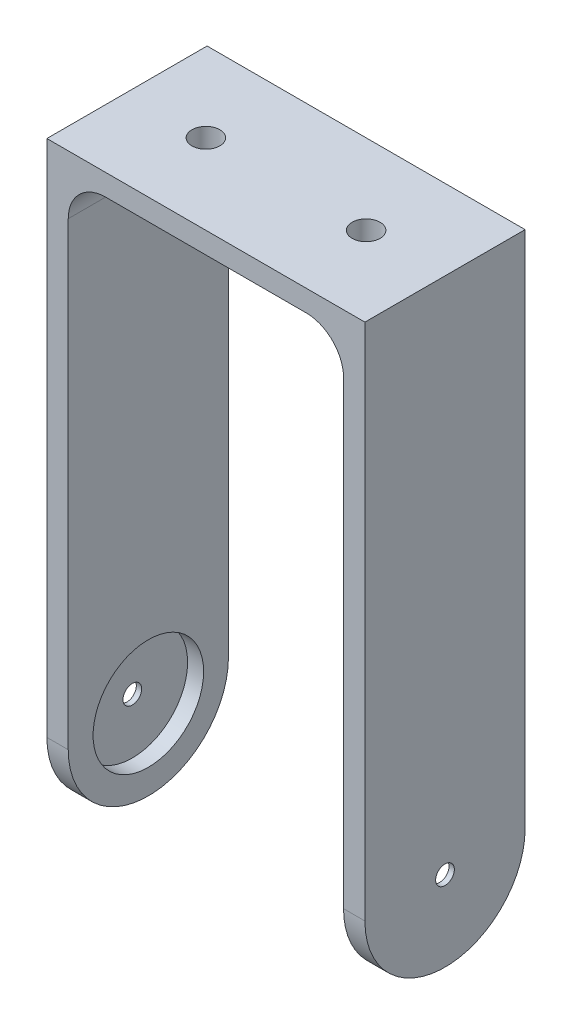
ISO-10303-21;
HEADER;
FILE_DESCRIPTION(('STEP AP214'),'2;1');
FILE_NAME('part.step','',(''),(''),'','','');
FILE_SCHEMA(('AUTOMOTIVE_DESIGN { 1 0 10303 214 1 1 1 1 }'));
ENDSEC;
DATA;
#1=APPLICATION_CONTEXT('core data for automotive mechanical design processes');
#2=APPLICATION_PROTOCOL_DEFINITION('international standard','automotive_design',2000,#1);
#3=PRODUCT_CONTEXT('',#1,'mechanical');
#4=PRODUCT('Part','Part','',(#3));
#5=PRODUCT_RELATED_PRODUCT_CATEGORY('part','',(#4));
#6=PRODUCT_DEFINITION_FORMATION('','',#4);
#7=PRODUCT_DEFINITION_CONTEXT('part definition',#1,'design');
#8=PRODUCT_DEFINITION('design','',#6,#7);
#9=PRODUCT_DEFINITION_SHAPE('','',#8);
#10=(LENGTH_UNIT() NAMED_UNIT(*) SI_UNIT(.MILLI.,.METRE.));
#11=(NAMED_UNIT(*) PLANE_ANGLE_UNIT() SI_UNIT($,.RADIAN.));
#12=(NAMED_UNIT(*) SI_UNIT($,.STERADIAN.) SOLID_ANGLE_UNIT());
#13=UNCERTAINTY_MEASURE_WITH_UNIT(LENGTH_MEASURE(1.E-05),#10,'distance_accuracy_value','');
#14=(GEOMETRIC_REPRESENTATION_CONTEXT(3) GLOBAL_UNCERTAINTY_ASSIGNED_CONTEXT((#13)) GLOBAL_UNIT_ASSIGNED_CONTEXT((#10,
#11,#12)) REPRESENTATION_CONTEXT('',''));
#15=CARTESIAN_POINT('',(0.,0.,0.));
#16=DIRECTION('',(0.,0.,1.));
#17=DIRECTION('',(1.,0.,0.));
#18=AXIS2_PLACEMENT_3D('',#15,#16,#17);
#19=CARTESIAN_POINT('',(25.7740385147519,-24.3,15.));
#20=DIRECTION('',(1.,0.,0.));
#21=DIRECTION('',(0.,0.,-1.));
#22=AXIS2_PLACEMENT_3D('',#19,#20,#21);
#23=PLANE('',#22);
#24=CARTESIAN_POINT('',(25.7740385147519,0.,0.));
#25=DIRECTION('',(1.,0.,0.));
#26=DIRECTION('',(0.,0.,-1.));
#27=AXIS2_PLACEMENT_3D('',#24,#25,#26);
#28=CIRCLE('',#27,15.);
#29=CARTESIAN_POINT('',(25.7740385147519,0.,15.));
#30=VERTEX_POINT('',#29);
#31=CARTESIAN_POINT('',(25.7740385147519,-14.5162799625254,3.77857328228293));
#32=VERTEX_POINT('',#31);
#33=EDGE_CURVE('E264',#30,#32,#28,.T.);
#34=ORIENTED_EDGE('',*,*,#33,.F.);
#35=DIRECTION('',(0.,1.,0.));
#36=VECTOR('',#35,1.);
#37=CARTESIAN_POINT('',(25.7740385147519,-24.3,15.));
#38=LINE('',#37,#36);
#39=CARTESIAN_POINT('',(25.7740385147519,86.1173023617038,15.));
#40=VERTEX_POINT('',#39);
#41=EDGE_CURVE('E208',#40,#30,#38,.F.);
#42=ORIENTED_EDGE('',*,*,#41,.F.);
#43=DIRECTION('',(0.,0.,-1.));
#44=VECTOR('',#43,1.);
#45=CARTESIAN_POINT('',(25.7740385147519,86.1173023617038,-15.));
#46=LINE('',#45,#44);
#47=CARTESIAN_POINT('',(25.7740385147519,86.1173023617038,-15.));
#48=VERTEX_POINT('',#47);
#49=EDGE_CURVE('E213',#40,#48,#46,.T.);
#50=ORIENTED_EDGE('',*,*,#49,.T.);
#51=DIRECTION('',(0.,1.,0.));
#52=VECTOR('',#51,1.);
#53=CARTESIAN_POINT('',(25.7740385147519,-24.3,-15.));
#54=LINE('',#53,#52);
#55=CARTESIAN_POINT('',(25.7740385147519,0.,-15.));
#56=VERTEX_POINT('',#55);
#57=EDGE_CURVE('E193',#48,#56,#54,.F.);
#58=ORIENTED_EDGE('',*,*,#57,.T.);
#59=CARTESIAN_POINT('',(25.7740385147519,-14.5162799625254,-3.77857328228313));
#60=VERTEX_POINT('',#59);
#61=EDGE_CURVE('E342',#60,#56,#28,.T.);
#62=ORIENTED_EDGE('',*,*,#61,.F.);
#63=DIRECTION('',(0.,-0.991520318498861,0.129951752600404));
#64=VECTOR('',#63,1.);
#65=CARTESIAN_POINT('',(25.7740385147519,-4.50889635455185,-5.09017226269496));
#66=LINE('',#65,#64);
#67=CARTESIAN_POINT('',(25.7740385147519,-4.50889635455185,-5.09017226269496));
#68=VERTEX_POINT('',#67);
#69=EDGE_CURVE('E295',#68,#60,#66,.T.);
#70=ORIENTED_EDGE('',*,*,#69,.F.);
#71=CARTESIAN_POINT('',(25.7740385147519,0.,0.));
#72=DIRECTION('',(-1.,0.,0.));
#73=DIRECTION('',(0.,0.,1.));
#74=AXIS2_PLACEMENT_3D('',#71,#72,#73);
#75=CIRCLE('',#74,6.8);
#76=CARTESIAN_POINT('',(25.7740385147519,4.50889635455188,-5.09017226269493));
#77=VERTEX_POINT('',#76);
#78=EDGE_CURVE('E298',#77,#68,#75,.T.);
#79=ORIENTED_EDGE('',*,*,#78,.F.);
#80=DIRECTION('',(0.,-0.99152031849886,-0.129951752600411));
#81=VECTOR('',#80,1.);
#82=CARTESIAN_POINT('',(25.7740385147519,22.1638649072812,-2.77625689179681));
#83=LINE('',#82,#81);
#84=CARTESIAN_POINT('',(25.7740385147519,22.1638649072812,-2.77625689179681));
#85=VERTEX_POINT('',#84);
#86=EDGE_CURVE('E301',#85,#77,#83,.T.);
#87=ORIENTED_EDGE('',*,*,#86,.F.);
#88=CARTESIAN_POINT('',(25.7740385147519,21.8,0.));
#89=DIRECTION('',(-1.,0.,0.));
#90=DIRECTION('',(0.,0.,1.));
#91=AXIS2_PLACEMENT_3D('',#88,#89,#90);
#92=CIRCLE('',#91,2.8);
#93=CARTESIAN_POINT('',(25.7740385147519,22.1638649072812,2.77625689179681));
#94=VERTEX_POINT('',#93);
#95=EDGE_CURVE('E304',#94,#85,#92,.T.);
#96=ORIENTED_EDGE('',*,*,#95,.F.);
#97=DIRECTION('',(0.,0.99152031849886,-0.129951752600411));
#98=VECTOR('',#97,1.);
#99=CARTESIAN_POINT('',(25.7740385147519,4.50889635455189,5.09017226269492));
#100=LINE('',#99,#98);
#101=CARTESIAN_POINT('',(25.7740385147519,4.50889635455189,5.09017226269492));
#102=VERTEX_POINT('',#101);
#103=EDGE_CURVE('E286',#102,#94,#100,.T.);
#104=ORIENTED_EDGE('',*,*,#103,.F.);
#105=CARTESIAN_POINT('',(25.7740385147519,0.,0.));
#106=DIRECTION('',(-1.,0.,0.));
#107=DIRECTION('',(0.,0.,1.));
#108=AXIS2_PLACEMENT_3D('',#105,#106,#107);
#109=CIRCLE('',#108,6.8);
#110=CARTESIAN_POINT('',(25.7740385147519,-4.50889635455192,5.09017226269489));
#111=VERTEX_POINT('',#110);
#112=EDGE_CURVE('E290',#111,#102,#109,.T.);
#113=ORIENTED_EDGE('',*,*,#112,.F.);
#114=DIRECTION('',(0.,0.991520318498859,0.129951752600418));
#115=VECTOR('',#114,1.);
#116=CARTESIAN_POINT('',(25.7740385147519,-22.1638649072812,2.77625689179666));
#117=LINE('',#116,#115);
#118=EDGE_CURVE('E293',#32,#111,#117,.T.);
#119=ORIENTED_EDGE('',*,*,#118,.F.);
#120=EDGE_LOOP('',(#34,#42,#50,#58,#62,#70,#79,#87,#96,#104,#113,#119));
#121=FACE_BOUND('',#120,.T.);
#122=ADVANCED_FACE('F35',(#121),#23,.F.);
#123=CARTESIAN_POINT('',(29.7740385147519,-24.3,15.));
#124=DIRECTION('',(1.,0.,0.));
#125=DIRECTION('',(0.,0.,-1.));
#126=AXIS2_PLACEMENT_3D('',#123,#124,#125);
#127=PLANE('',#126);
#128=CARTESIAN_POINT('',(29.7740385147519,0.,0.));
#129=DIRECTION('',(1.,0.,0.));
#130=DIRECTION('',(0.,0.,-1.));
#131=AXIS2_PLACEMENT_3D('',#128,#129,#130);
#132=CIRCLE('',#131,1.75);
#133=CARTESIAN_POINT('',(29.7740385147519,0.,-1.75));
#134=VERTEX_POINT('',#133);
#135=EDGE_CURVE('E329',#134,#134,#132,.T.);
#136=ORIENTED_EDGE('',*,*,#135,.F.);
#137=EDGE_LOOP('',(#136));
#138=FACE_BOUND('',#137,.T.);
#139=DIRECTION('',(0.,-1.,0.));
#140=VECTOR('',#139,1.);
#141=CARTESIAN_POINT('',(29.7740385147519,-24.3,15.));
#142=LINE('',#141,#140);
#143=CARTESIAN_POINT('',(29.7740385147519,97.1173023617038,15.));
#144=VERTEX_POINT('',#143);
#145=CARTESIAN_POINT('',(29.7740385147519,0.,15.));
#146=VERTEX_POINT('',#145);
#147=EDGE_CURVE('E186',#144,#146,#142,.T.);
#148=ORIENTED_EDGE('',*,*,#147,.T.);
#149=CARTESIAN_POINT('',(29.7740385147519,0.,0.));
#150=DIRECTION('',(1.,0.,0.));
#151=DIRECTION('',(0.,0.,-1.));
#152=AXIS2_PLACEMENT_3D('',#149,#150,#151);
#153=CIRCLE('',#152,15.);
#154=CARTESIAN_POINT('',(29.7740385147519,0.,-15.));
#155=VERTEX_POINT('',#154);
#156=EDGE_CURVE('E338',#146,#155,#153,.T.);
#157=ORIENTED_EDGE('',*,*,#156,.T.);
#158=DIRECTION('',(0.,-1.,0.));
#159=VECTOR('',#158,1.);
#160=CARTESIAN_POINT('',(29.7740385147519,-24.3,-15.));
#161=LINE('',#160,#159);
#162=CARTESIAN_POINT('',(29.7740385147519,97.1173023617038,-15.));
#163=VERTEX_POINT('',#162);
#164=EDGE_CURVE('E196',#163,#155,#161,.T.);
#165=ORIENTED_EDGE('',*,*,#164,.F.);
#166=DIRECTION('',(0.,0.,-1.));
#167=VECTOR('',#166,1.);
#168=CARTESIAN_POINT('',(29.7740385147519,97.1173023617038,15.));
#169=LINE('',#168,#167);
#170=EDGE_CURVE('E210',#144,#163,#169,.T.);
#171=ORIENTED_EDGE('',*,*,#170,.F.);
#172=EDGE_LOOP('',(#148,#157,#165,#171));
#173=FACE_BOUND('',#172,.T.);
#174=ADVANCED_FACE('F390',(#138,#173),#127,.T.);
#175=CARTESIAN_POINT('',(-29.7740385147519,-24.3,15.));
#176=DIRECTION('',(-1.,0.,0.));
#177=DIRECTION('',(0.,0.,1.));
#178=AXIS2_PLACEMENT_3D('',#175,#176,#177);
#179=PLANE('',#178);
#180=CARTESIAN_POINT('',(-29.7740385147519,0.,0.));
#181=DIRECTION('',(-1.,0.,0.));
#182=DIRECTION('',(0.,0.,1.));
#183=AXIS2_PLACEMENT_3D('',#180,#181,#182);
#184=CIRCLE('',#183,1.75);
#185=CARTESIAN_POINT('',(-29.7740385147519,0.,1.75));
#186=VERTEX_POINT('',#185);
#187=EDGE_CURVE('E225',#186,#186,#184,.T.);
#188=ORIENTED_EDGE('',*,*,#187,.F.);
#189=EDGE_LOOP('',(#188));
#190=FACE_BOUND('',#189,.T.);
#191=DIRECTION('',(0.,1.,0.));
#192=VECTOR('',#191,1.);
#193=CARTESIAN_POINT('',(-29.7740385147519,-24.3,-15.));
#194=LINE('',#193,#192);
#195=CARTESIAN_POINT('',(-29.7740385147519,0.,-15.));
#196=VERTEX_POINT('',#195);
#197=CARTESIAN_POINT('',(-29.7740385147519,97.1173023617038,-15.));
#198=VERTEX_POINT('',#197);
#199=EDGE_CURVE('E173',#196,#198,#194,.T.);
#200=ORIENTED_EDGE('',*,*,#199,.F.);
#201=CARTESIAN_POINT('',(-29.7740385147519,0.,0.));
#202=DIRECTION('',(-1.,0.,0.));
#203=DIRECTION('',(0.,0.,1.));
#204=AXIS2_PLACEMENT_3D('',#201,#202,#203);
#205=CIRCLE('',#204,15.);
#206=CARTESIAN_POINT('',(-29.7740385147519,0.,15.));
#207=VERTEX_POINT('',#206);
#208=EDGE_CURVE('E50',#196,#207,#205,.T.);
#209=ORIENTED_EDGE('',*,*,#208,.T.);
#210=DIRECTION('',(0.,1.,0.));
#211=VECTOR('',#210,1.);
#212=CARTESIAN_POINT('',(-29.7740385147519,-24.3,15.));
#213=LINE('',#212,#211);
#214=CARTESIAN_POINT('',(-29.7740385147519,97.1173023617038,15.));
#215=VERTEX_POINT('',#214);
#216=EDGE_CURVE('E171',#207,#215,#213,.T.);
#217=ORIENTED_EDGE('',*,*,#216,.T.);
#218=DIRECTION('',(0.,0.,-1.));
#219=VECTOR('',#218,1.);
#220=CARTESIAN_POINT('',(-29.7740385147519,97.1173023617038,15.));
#221=LINE('',#220,#219);
#222=EDGE_CURVE('E192',#215,#198,#221,.T.);
#223=ORIENTED_EDGE('',*,*,#222,.T.);
#224=EDGE_LOOP('',(#200,#209,#217,#223));
#225=FACE_BOUND('',#224,.T.);
#226=ADVANCED_FACE('F169',(#190,#225),#179,.T.);
#227=CARTESIAN_POINT('',(-25.7740385147519,-24.3,15.));
#228=DIRECTION('',(-1.,0.,0.));
#229=DIRECTION('',(0.,0.,1.));
#230=AXIS2_PLACEMENT_3D('',#227,#228,#229);
#231=PLANE('',#230);
#232=CARTESIAN_POINT('',(-25.7740385147519,0.,0.));
#233=DIRECTION('',(1.,0.,0.));
#234=DIRECTION('',(0.,0.,-1.));
#235=AXIS2_PLACEMENT_3D('',#232,#233,#234);
#236=CIRCLE('',#235,10.35);
#237=CARTESIAN_POINT('',(-25.7740385147519,0.,-10.35));
#238=VERTEX_POINT('',#237);
#239=EDGE_CURVE('E326',#238,#238,#236,.T.);
#240=ORIENTED_EDGE('',*,*,#239,.F.);
#241=EDGE_LOOP('',(#240));
#242=FACE_BOUND('',#241,.T.);
#243=CARTESIAN_POINT('',(-25.7740385147519,0.,0.));
#244=DIRECTION('',(-1.,0.,0.));
#245=DIRECTION('',(0.,0.,1.));
#246=AXIS2_PLACEMENT_3D('',#243,#244,#245);
#247=CIRCLE('',#246,15.);
#248=CARTESIAN_POINT('',(-25.7740385147519,0.,-15.));
#249=VERTEX_POINT('',#248);
#250=CARTESIAN_POINT('',(-25.7740385147519,0.,15.));
#251=VERTEX_POINT('',#250);
#252=EDGE_CURVE('E160',#249,#251,#247,.T.);
#253=ORIENTED_EDGE('',*,*,#252,.F.);
#254=DIRECTION('',(0.,1.,0.));
#255=VECTOR('',#254,1.);
#256=CARTESIAN_POINT('',(-25.7740385147519,-24.3,-15.));
#257=LINE('',#256,#255);
#258=CARTESIAN_POINT('',(-25.7740385147519,86.1173023617038,-15.));
#259=VERTEX_POINT('',#258);
#260=EDGE_CURVE('E203',#249,#259,#257,.T.);
#261=ORIENTED_EDGE('',*,*,#260,.T.);
#262=DIRECTION('',(0.,0.,-1.));
#263=VECTOR('',#262,1.);
#264=CARTESIAN_POINT('',(-25.7740385147519,86.1173023617038,15.));
#265=LINE('',#264,#263);
#266=CARTESIAN_POINT('',(-25.7740385147519,86.1173023617038,15.));
#267=VERTEX_POINT('',#266);
#268=EDGE_CURVE('E233',#259,#267,#265,.F.);
#269=ORIENTED_EDGE('',*,*,#268,.T.);
#270=DIRECTION('',(0.,1.,0.));
#271=VECTOR('',#270,1.);
#272=CARTESIAN_POINT('',(-25.7740385147519,-24.3,15.));
#273=LINE('',#272,#271);
#274=EDGE_CURVE('E182',#251,#267,#273,.T.);
#275=ORIENTED_EDGE('',*,*,#274,.F.);
#276=EDGE_LOOP('',(#253,#261,#269,#275));
#277=FACE_BOUND('',#276,.T.);
#278=ADVANCED_FACE('F429',(#242,#277),#231,.F.);
#279=CARTESIAN_POINT('',(28.7740385147519,-22.1638649072812,2.77625689179666));
#280=DIRECTION('',(0.,-0.129951752600418,0.991520318498859));
#281=DIRECTION('',(0.,-0.99152031849886,-0.129951752600418));
#282=AXIS2_PLACEMENT_3D('',#279,#280,#281);
#283=PLANE('',#282);
#284=DIRECTION('',(-1.,0.,0.));
#285=VECTOR('',#284,1.);
#286=CARTESIAN_POINT('',(50.2259614852481,-14.5162799625254,3.77857328228293));
#287=LINE('',#286,#285);
#288=CARTESIAN_POINT('',(28.7740385147519,-14.5162799625254,3.77857328228293));
#289=VERTEX_POINT('',#288);
#290=EDGE_CURVE('E58',#32,#289,#287,.F.);
#291=ORIENTED_EDGE('',*,*,#290,.F.);
#292=ORIENTED_EDGE('',*,*,#118,.T.);
#293=DIRECTION('',(-1.,0.,0.));
#294=VECTOR('',#293,1.);
#295=CARTESIAN_POINT('',(28.7740385147519,-4.50889635455192,5.09017226269489));
#296=LINE('',#295,#294);
#297=CARTESIAN_POINT('',(28.7740385147519,-4.50889635455192,5.09017226269489));
#298=VERTEX_POINT('',#297);
#299=EDGE_CURVE('E280',#298,#111,#296,.T.);
#300=ORIENTED_EDGE('',*,*,#299,.F.);
#301=DIRECTION('',(0.,0.991520318498859,0.129951752600418));
#302=VECTOR('',#301,1.);
#303=CARTESIAN_POINT('',(28.7740385147519,-22.1638649072812,2.77625689179666));
#304=LINE('',#303,#302);
#305=EDGE_CURVE('E313',#289,#298,#304,.T.);
#306=ORIENTED_EDGE('',*,*,#305,.F.);
#307=EDGE_LOOP('',(#291,#292,#300,#306));
#308=FACE_BOUND('',#307,.T.);
#309=ADVANCED_FACE('F378',(#308),#283,.F.);
#310=CARTESIAN_POINT('',(28.7740385147519,-4.50889635455185,-5.09017226269496));
#311=DIRECTION('',(0.,-0.129951752600404,-0.991520318498861));
#312=DIRECTION('',(0.,0.991520318498861,-0.129951752600404));
#313=AXIS2_PLACEMENT_3D('',#310,#311,#312);
#314=PLANE('',#313);
#315=DIRECTION('',(-1.,0.,0.));
#316=VECTOR('',#315,1.);
#317=CARTESIAN_POINT('',(50.2259614852481,-14.5162799625254,-3.77857328228313));
#318=LINE('',#317,#316);
#319=CARTESIAN_POINT('',(28.7740385147519,-14.5162799625254,-3.77857328228313));
#320=VERTEX_POINT('',#319);
#321=EDGE_CURVE('E345',#320,#60,#318,.T.);
#322=ORIENTED_EDGE('',*,*,#321,.F.);
#323=DIRECTION('',(0.,-0.991520318498861,0.129951752600404));
#324=VECTOR('',#323,1.);
#325=CARTESIAN_POINT('',(28.7740385147519,-4.50889635455185,-5.09017226269496));
#326=LINE('',#325,#324);
#327=CARTESIAN_POINT('',(28.7740385147519,-4.50889635455185,-5.09017226269496));
#328=VERTEX_POINT('',#327);
#329=EDGE_CURVE('E315',#328,#320,#326,.T.);
#330=ORIENTED_EDGE('',*,*,#329,.F.);
#331=DIRECTION('',(-1.,0.,0.));
#332=VECTOR('',#331,1.);
#333=CARTESIAN_POINT('',(28.7740385147519,-4.50889635455185,-5.09017226269496));
#334=LINE('',#333,#332);
#335=EDGE_CURVE('E278',#328,#68,#334,.T.);
#336=ORIENTED_EDGE('',*,*,#335,.T.);
#337=ORIENTED_EDGE('',*,*,#69,.T.);
#338=EDGE_LOOP('',(#322,#330,#336,#337));
#339=FACE_BOUND('',#338,.T.);
#340=ADVANCED_FACE('F354',(#339),#314,.F.);
#341=CARTESIAN_POINT('',(28.7740385147519,21.8,0.));
#342=DIRECTION('',(-1.,0.,0.));
#343=DIRECTION('',(0.,0.,1.));
#344=AXIS2_PLACEMENT_3D('',#341,#342,#343);
#345=PLANE('',#344);
#346=CARTESIAN_POINT('',(28.7740385147519,0.,0.));
#347=DIRECTION('',(-1.,0.,0.));
#348=DIRECTION('',(0.,0.,1.));
#349=AXIS2_PLACEMENT_3D('',#346,#347,#348);
#350=CIRCLE('',#349,1.75);
#351=CARTESIAN_POINT('',(28.7740385147519,0.,1.75));
#352=VERTEX_POINT('',#351);
#353=EDGE_CURVE('E224',#352,#352,#350,.T.);
#354=ORIENTED_EDGE('',*,*,#353,.F.);
#355=EDGE_LOOP('',(#354));
#356=FACE_BOUND('',#355,.T.);
#357=ORIENTED_EDGE('',*,*,#329,.T.);
#358=CARTESIAN_POINT('',(28.7740385147519,0.,0.));
#359=DIRECTION('',(-1.,0.,0.));
#360=DIRECTION('',(0.,0.,1.));
#361=AXIS2_PLACEMENT_3D('',#358,#359,#360);
#362=CIRCLE('',#361,15.);
#363=EDGE_CURVE('E11',#320,#289,#362,.T.);
#364=ORIENTED_EDGE('',*,*,#363,.T.);
#365=ORIENTED_EDGE('',*,*,#305,.T.);
#366=CARTESIAN_POINT('',(28.7740385147519,0.,0.));
#367=DIRECTION('',(-1.,0.,0.));
#368=DIRECTION('',(0.,0.,1.));
#369=AXIS2_PLACEMENT_3D('',#366,#367,#368);
#370=CIRCLE('',#369,6.8);
#371=CARTESIAN_POINT('',(28.7740385147519,4.50889635455189,5.09017226269492));
#372=VERTEX_POINT('',#371);
#373=EDGE_CURVE('E310',#298,#372,#370,.T.);
#374=ORIENTED_EDGE('',*,*,#373,.T.);
#375=DIRECTION('',(0.,0.99152031849886,-0.129951752600411));
#376=VECTOR('',#375,1.);
#377=CARTESIAN_POINT('',(28.7740385147519,4.50889635455189,5.09017226269492));
#378=LINE('',#377,#376);
#379=CARTESIAN_POINT('',(28.7740385147519,22.1638649072812,2.77625689179681));
#380=VERTEX_POINT('',#379);
#381=EDGE_CURVE('E276',#372,#380,#378,.T.);
#382=ORIENTED_EDGE('',*,*,#381,.T.);
#383=CARTESIAN_POINT('',(28.7740385147519,21.8,0.));
#384=DIRECTION('',(-1.,0.,0.));
#385=DIRECTION('',(0.,0.,1.));
#386=AXIS2_PLACEMENT_3D('',#383,#384,#385);
#387=CIRCLE('',#386,2.8);
#388=CARTESIAN_POINT('',(28.7740385147519,22.1638649072812,-2.77625689179681));
#389=VERTEX_POINT('',#388);
#390=EDGE_CURVE('E289',#380,#389,#387,.T.);
#391=ORIENTED_EDGE('',*,*,#390,.T.);
#392=DIRECTION('',(0.,-0.99152031849886,-0.129951752600411));
#393=VECTOR('',#392,1.);
#394=CARTESIAN_POINT('',(28.7740385147519,22.1638649072812,-2.77625689179681));
#395=LINE('',#394,#393);
#396=CARTESIAN_POINT('',(28.7740385147519,4.50889635455188,-5.09017226269493));
#397=VERTEX_POINT('',#396);
#398=EDGE_CURVE('E321',#389,#397,#395,.T.);
#399=ORIENTED_EDGE('',*,*,#398,.T.);
#400=CARTESIAN_POINT('',(28.7740385147519,0.,0.));
#401=DIRECTION('',(-1.,0.,0.));
#402=DIRECTION('',(0.,0.,1.));
#403=AXIS2_PLACEMENT_3D('',#400,#401,#402);
#404=CIRCLE('',#403,6.8);
#405=EDGE_CURVE('E318',#397,#328,#404,.T.);
#406=ORIENTED_EDGE('',*,*,#405,.T.);
#407=EDGE_LOOP('',(#357,#364,#365,#374,#382,#391,#399,#406));
#408=FACE_BOUND('',#407,.T.);
#409=ADVANCED_FACE('F380',(#356,#408),#345,.T.);
#410=CARTESIAN_POINT('',(-29.7740385147519,97.1173023617038,15.));
#411=DIRECTION('',(0.,1.,0.));
#412=DIRECTION('',(0.,0.,1.));
#413=AXIS2_PLACEMENT_3D('',#410,#411,#412);
#414=PLANE('',#413);
#415=CARTESIAN_POINT('',(15.,97.1173023617038,1.04744440165294E-13));
#416=DIRECTION('',(0.,1.,0.));
#417=DIRECTION('',(0.,0.,1.));
#418=AXIS2_PLACEMENT_3D('',#415,#416,#417);
#419=CIRCLE('',#418,2.62067407029812);
#420=CARTESIAN_POINT('',(15.,97.1173023617038,2.62067407029823));
#421=VERTEX_POINT('',#420);
#422=EDGE_CURVE('E220',#421,#421,#419,.T.);
#423=ORIENTED_EDGE('',*,*,#422,.F.);
#424=EDGE_LOOP('',(#423));
#425=FACE_BOUND('',#424,.T.);
#426=CARTESIAN_POINT('',(-15.,97.1173023617038,0.));
#427=DIRECTION('',(0.,1.,0.));
#428=DIRECTION('',(0.,0.,1.));
#429=AXIS2_PLACEMENT_3D('',#426,#427,#428);
#430=CIRCLE('',#429,2.62067407029812);
#431=CARTESIAN_POINT('',(-15.,97.1173023617038,2.62067407029812));
#432=VERTEX_POINT('',#431);
#433=EDGE_CURVE('E216',#432,#432,#430,.T.);
#434=ORIENTED_EDGE('',*,*,#433,.F.);
#435=EDGE_LOOP('',(#434));
#436=FACE_BOUND('',#435,.T.);
#437=DIRECTION('',(1.,0.,0.));
#438=VECTOR('',#437,1.);
#439=CARTESIAN_POINT('',(-29.7740385147519,97.1173023617038,-15.));
#440=LINE('',#439,#438);
#441=EDGE_CURVE('E200',#198,#163,#440,.T.);
#442=ORIENTED_EDGE('',*,*,#441,.F.);
#443=ORIENTED_EDGE('',*,*,#222,.F.);
#444=DIRECTION('',(1.,0.,0.));
#445=VECTOR('',#444,1.);
#446=CARTESIAN_POINT('',(29.7740385147519,97.1173023617038,15.));
#447=LINE('',#446,#445);
#448=EDGE_CURVE('E180',#215,#144,#447,.T.);
#449=ORIENTED_EDGE('',*,*,#448,.T.);
#450=ORIENTED_EDGE('',*,*,#170,.T.);
#451=EDGE_LOOP('',(#442,#443,#449,#450));
#452=FACE_BOUND('',#451,.T.);
#453=ADVANCED_FACE('F421',(#425,#436,#452),#414,.T.);
#454=CARTESIAN_POINT('',(29.7740385147519,93.1173023617038,15.));
#455=DIRECTION('',(0.,1.,0.));
#456=DIRECTION('',(0.,0.,1.));
#457=AXIS2_PLACEMENT_3D('',#454,#455,#456);
#458=PLANE('',#457);
#459=CARTESIAN_POINT('',(15.,93.1173023617038,1.04744440165294E-13));
#460=DIRECTION('',(0.,1.,0.));
#461=DIRECTION('',(0.,0.,1.));
#462=AXIS2_PLACEMENT_3D('',#459,#460,#461);
#463=CIRCLE('',#462,2.62067407029812);
#464=CARTESIAN_POINT('',(15.,93.1173023617038,2.62067407029823));
#465=VERTEX_POINT('',#464);
#466=EDGE_CURVE('E217',#465,#465,#463,.T.);
#467=ORIENTED_EDGE('',*,*,#466,.T.);
#468=EDGE_LOOP('',(#467));
#469=FACE_BOUND('',#468,.T.);
#470=CARTESIAN_POINT('',(-15.,93.1173023617038,0.));
#471=DIRECTION('',(0.,1.,0.));
#472=DIRECTION('',(0.,0.,1.));
#473=AXIS2_PLACEMENT_3D('',#470,#471,#472);
#474=CIRCLE('',#473,2.62067407029812);
#475=CARTESIAN_POINT('',(-15.,93.1173023617038,2.62067407029812));
#476=VERTEX_POINT('',#475);
#477=EDGE_CURVE('E197',#476,#476,#474,.T.);
#478=ORIENTED_EDGE('',*,*,#477,.T.);
#479=EDGE_LOOP('',(#478));
#480=FACE_BOUND('',#479,.T.);
#481=DIRECTION('',(1.,0.,0.));
#482=VECTOR('',#481,1.);
#483=CARTESIAN_POINT('',(29.7740385147519,93.1173023617038,-15.));
#484=LINE('',#483,#482);
#485=CARTESIAN_POINT('',(-18.7740385147519,93.1173023617038,-15.));
#486=VERTEX_POINT('',#485);
#487=CARTESIAN_POINT('',(18.7740385147519,93.1173023617038,-15.));
#488=VERTEX_POINT('',#487);
#489=EDGE_CURVE('E205',#486,#488,#484,.T.);
#490=ORIENTED_EDGE('',*,*,#489,.T.);
#491=DIRECTION('',(0.,0.,-1.));
#492=VECTOR('',#491,1.);
#493=CARTESIAN_POINT('',(18.7740385147519,93.1173023617038,15.));
#494=LINE('',#493,#492);
#495=CARTESIAN_POINT('',(18.7740385147519,93.1173023617038,15.));
#496=VERTEX_POINT('',#495);
#497=EDGE_CURVE('E231',#488,#496,#494,.F.);
#498=ORIENTED_EDGE('',*,*,#497,.T.);
#499=DIRECTION('',(1.,0.,0.));
#500=VECTOR('',#499,1.);
#501=CARTESIAN_POINT('',(-29.7740385147519,93.1173023617038,15.));
#502=LINE('',#501,#500);
#503=CARTESIAN_POINT('',(-18.7740385147519,93.1173023617038,15.));
#504=VERTEX_POINT('',#503);
#505=EDGE_CURVE('E184',#504,#496,#502,.T.);
#506=ORIENTED_EDGE('',*,*,#505,.F.);
#507=DIRECTION('',(0.,0.,-1.));
#508=VECTOR('',#507,1.);
#509=CARTESIAN_POINT('',(-18.7740385147519,93.1173023617038,-15.));
#510=LINE('',#509,#508);
#511=EDGE_CURVE('E228',#504,#486,#510,.T.);
#512=ORIENTED_EDGE('',*,*,#511,.T.);
#513=EDGE_LOOP('',(#490,#498,#506,#512));
#514=FACE_BOUND('',#513,.T.);
#515=ADVANCED_FACE('F249',(#469,#480,#514),#458,.F.);
#516=CARTESIAN_POINT('',(0.,0.,15.));
#517=DIRECTION('',(0.,0.,1.));
#518=DIRECTION('',(1.,0.,0.));
#519=AXIS2_PLACEMENT_3D('',#516,#517,#518);
#520=PLANE('',#519);
#521=DIRECTION('',(-1.,0.,0.));
#522=VECTOR('',#521,1.);
#523=CARTESIAN_POINT('',(50.2259614852481,0.,15.));
#524=LINE('',#523,#522);
#525=EDGE_CURVE('E164',#146,#30,#524,.T.);
#526=ORIENTED_EDGE('',*,*,#525,.F.);
#527=ORIENTED_EDGE('',*,*,#147,.F.);
#528=ORIENTED_EDGE('',*,*,#448,.F.);
#529=ORIENTED_EDGE('',*,*,#216,.F.);
#530=EDGE_CURVE('E157',#251,#207,#524,.T.);
#531=ORIENTED_EDGE('',*,*,#530,.F.);
#532=ORIENTED_EDGE('',*,*,#274,.T.);
#533=CARTESIAN_POINT('',(-18.7740385147519,86.1173023617038,15.));
#534=DIRECTION('',(0.,0.,1.));
#535=DIRECTION('',(1.,0.,0.));
#536=AXIS2_PLACEMENT_3D('',#533,#534,#535);
#537=CIRCLE('',#536,7.);
#538=EDGE_CURVE('E43',#267,#504,#537,.F.);
#539=ORIENTED_EDGE('',*,*,#538,.T.);
#540=ORIENTED_EDGE('',*,*,#505,.T.);
#541=CARTESIAN_POINT('',(18.7740385147519,86.1173023617038,15.));
#542=DIRECTION('',(0.,0.,1.));
#543=DIRECTION('',(1.,0.,0.));
#544=AXIS2_PLACEMENT_3D('',#541,#542,#543);
#545=CIRCLE('',#544,7.);
#546=EDGE_CURVE('E238',#496,#40,#545,.F.);
#547=ORIENTED_EDGE('',*,*,#546,.T.);
#548=ORIENTED_EDGE('',*,*,#41,.T.);
#549=EDGE_LOOP('',(#526,#527,#528,#529,#531,#532,#539,#540,#547,#548));
#550=FACE_BOUND('',#549,.T.);
#551=ADVANCED_FACE('F177',(#550),#520,.T.);
#552=CARTESIAN_POINT('',(0.,0.,-15.));
#553=DIRECTION('',(0.,0.,1.));
#554=DIRECTION('',(1.,0.,0.));
#555=AXIS2_PLACEMENT_3D('',#552,#553,#554);
#556=PLANE('',#555);
#557=ORIENTED_EDGE('',*,*,#164,.T.);
#558=DIRECTION('',(-1.,0.,0.));
#559=VECTOR('',#558,1.);
#560=CARTESIAN_POINT('',(50.2259614852481,0.,-15.));
#561=LINE('',#560,#559);
#562=EDGE_CURVE('E165',#155,#56,#561,.T.);
#563=ORIENTED_EDGE('',*,*,#562,.T.);
#564=ORIENTED_EDGE('',*,*,#57,.F.);
#565=CARTESIAN_POINT('',(18.7740385147519,86.1173023617038,-15.));
#566=DIRECTION('',(0.,0.,1.));
#567=DIRECTION('',(1.,0.,0.));
#568=AXIS2_PLACEMENT_3D('',#565,#566,#567);
#569=CIRCLE('',#568,7.);
#570=EDGE_CURVE('E236',#48,#488,#569,.T.);
#571=ORIENTED_EDGE('',*,*,#570,.T.);
#572=ORIENTED_EDGE('',*,*,#489,.F.);
#573=CARTESIAN_POINT('',(-18.7740385147519,86.1173023617038,-15.));
#574=DIRECTION('',(0.,0.,1.));
#575=DIRECTION('',(1.,0.,0.));
#576=AXIS2_PLACEMENT_3D('',#573,#574,#575);
#577=CIRCLE('',#576,7.);
#578=EDGE_CURVE('E240',#486,#259,#577,.T.);
#579=ORIENTED_EDGE('',*,*,#578,.T.);
#580=ORIENTED_EDGE('',*,*,#260,.F.);
#581=EDGE_CURVE('E174',#249,#196,#561,.T.);
#582=ORIENTED_EDGE('',*,*,#581,.T.);
#583=ORIENTED_EDGE('',*,*,#199,.T.);
#584=ORIENTED_EDGE('',*,*,#441,.T.);
#585=EDGE_LOOP('',(#557,#563,#564,#571,#572,#579,#580,#582,#583,#584));
#586=FACE_BOUND('',#585,.T.);
#587=ADVANCED_FACE('F254',(#586),#556,.F.);
#588=CARTESIAN_POINT('',(-15.,67.1173023617038,0.));
#589=DIRECTION('',(0.,1.,0.));
#590=DIRECTION('',(0.,0.,1.));
#591=AXIS2_PLACEMENT_3D('',#588,#589,#590);
#592=CYLINDRICAL_SURFACE('',#591,2.62067407029812);
#593=ORIENTED_EDGE('',*,*,#433,.T.);
#594=EDGE_LOOP('',(#593));
#595=FACE_BOUND('',#594,.T.);
#596=ORIENTED_EDGE('',*,*,#477,.F.);
#597=EDGE_LOOP('',(#596));
#598=FACE_BOUND('',#597,.T.);
#599=ADVANCED_FACE('F441',(#595,#598),#592,.F.);
#600=CARTESIAN_POINT('',(15.,67.1173023617038,1.04744440165294E-13));
#601=DIRECTION('',(0.,1.,0.));
#602=DIRECTION('',(0.,0.,1.));
#603=AXIS2_PLACEMENT_3D('',#600,#601,#602);
#604=CYLINDRICAL_SURFACE('',#603,2.62067407029812);
#605=ORIENTED_EDGE('',*,*,#422,.T.);
#606=EDGE_LOOP('',(#605));
#607=FACE_BOUND('',#606,.T.);
#608=ORIENTED_EDGE('',*,*,#466,.F.);
#609=EDGE_LOOP('',(#608));
#610=FACE_BOUND('',#609,.T.);
#611=ADVANCED_FACE('F438',(#607,#610),#604,.F.);
#612=CARTESIAN_POINT('',(28.7740385147519,21.8,0.));
#613=DIRECTION('',(-1.,0.,0.));
#614=DIRECTION('',(0.,0.,1.));
#615=AXIS2_PLACEMENT_3D('',#612,#613,#614);
#616=CYLINDRICAL_SURFACE('',#615,2.8);
#617=ORIENTED_EDGE('',*,*,#95,.T.);
#618=DIRECTION('',(-1.,0.,0.));
#619=VECTOR('',#618,1.);
#620=CARTESIAN_POINT('',(28.7740385147519,22.1638649072812,-2.77625689179681));
#621=LINE('',#620,#619);
#622=EDGE_CURVE('E273',#389,#85,#621,.T.);
#623=ORIENTED_EDGE('',*,*,#622,.F.);
#624=ORIENTED_EDGE('',*,*,#390,.F.);
#625=DIRECTION('',(-1.,0.,0.));
#626=VECTOR('',#625,1.);
#627=CARTESIAN_POINT('',(28.7740385147519,22.1638649072812,2.77625689179681));
#628=LINE('',#627,#626);
#629=EDGE_CURVE('E272',#380,#94,#628,.T.);
#630=ORIENTED_EDGE('',*,*,#629,.T.);
#631=EDGE_LOOP('',(#617,#623,#624,#630));
#632=FACE_BOUND('',#631,.T.);
#633=ADVANCED_FACE('F367',(#632),#616,.F.);
#634=CARTESIAN_POINT('',(28.7740385147519,4.50889635455189,5.09017226269492));
#635=DIRECTION('',(0.,0.129951752600411,0.99152031849886));
#636=DIRECTION('',(0.,-0.99152031849886,0.129951752600411));
#637=AXIS2_PLACEMENT_3D('',#634,#635,#636);
#638=PLANE('',#637);
#639=ORIENTED_EDGE('',*,*,#103,.T.);
#640=ORIENTED_EDGE('',*,*,#629,.F.);
#641=ORIENTED_EDGE('',*,*,#381,.F.);
#642=DIRECTION('',(-1.,0.,0.));
#643=VECTOR('',#642,1.);
#644=CARTESIAN_POINT('',(28.7740385147519,4.50889635455189,5.09017226269492));
#645=LINE('',#644,#643);
#646=EDGE_CURVE('E283',#372,#102,#645,.T.);
#647=ORIENTED_EDGE('',*,*,#646,.T.);
#648=EDGE_LOOP('',(#639,#640,#641,#647));
#649=FACE_BOUND('',#648,.T.);
#650=ADVANCED_FACE('F370',(#649),#638,.F.);
#651=CARTESIAN_POINT('',(28.7740385147519,0.,0.));
#652=DIRECTION('',(-1.,0.,0.));
#653=DIRECTION('',(0.,0.,1.));
#654=AXIS2_PLACEMENT_3D('',#651,#652,#653);
#655=CYLINDRICAL_SURFACE('',#654,6.8);
#656=ORIENTED_EDGE('',*,*,#112,.T.);
#657=ORIENTED_EDGE('',*,*,#646,.F.);
#658=ORIENTED_EDGE('',*,*,#373,.F.);
#659=ORIENTED_EDGE('',*,*,#299,.T.);
#660=EDGE_LOOP('',(#656,#657,#658,#659));
#661=FACE_BOUND('',#660,.T.);
#662=ADVANCED_FACE('F373',(#661),#655,.F.);
#663=CARTESIAN_POINT('',(28.7740385147519,0.,0.));
#664=DIRECTION('',(-1.,0.,0.));
#665=DIRECTION('',(0.,0.,1.));
#666=AXIS2_PLACEMENT_3D('',#663,#664,#665);
#667=CYLINDRICAL_SURFACE('',#666,6.8);
#668=ORIENTED_EDGE('',*,*,#78,.T.);
#669=ORIENTED_EDGE('',*,*,#335,.F.);
#670=ORIENTED_EDGE('',*,*,#405,.F.);
#671=DIRECTION('',(-1.,0.,0.));
#672=VECTOR('',#671,1.);
#673=CARTESIAN_POINT('',(28.7740385147519,4.50889635455188,-5.09017226269493));
#674=LINE('',#673,#672);
#675=EDGE_CURVE('E275',#397,#77,#674,.T.);
#676=ORIENTED_EDGE('',*,*,#675,.T.);
#677=EDGE_LOOP('',(#668,#669,#670,#676));
#678=FACE_BOUND('',#677,.T.);
#679=ADVANCED_FACE('F358',(#678),#667,.F.);
#680=CARTESIAN_POINT('',(28.7740385147519,22.1638649072812,-2.77625689179681));
#681=DIRECTION('',(0.,0.129951752600411,-0.99152031849886));
#682=DIRECTION('',(0.,0.99152031849886,0.129951752600411));
#683=AXIS2_PLACEMENT_3D('',#680,#681,#682);
#684=PLANE('',#683);
#685=ORIENTED_EDGE('',*,*,#86,.T.);
#686=ORIENTED_EDGE('',*,*,#675,.F.);
#687=ORIENTED_EDGE('',*,*,#398,.F.);
#688=ORIENTED_EDGE('',*,*,#622,.T.);
#689=EDGE_LOOP('',(#685,#686,#687,#688));
#690=FACE_BOUND('',#689,.T.);
#691=ADVANCED_FACE('F363',(#690),#684,.F.);
#692=CARTESIAN_POINT('',(-28.7740385147519,0.,0.));
#693=DIRECTION('',(1.,0.,0.));
#694=DIRECTION('',(0.,0.,-1.));
#695=AXIS2_PLACEMENT_3D('',#692,#693,#694);
#696=CYLINDRICAL_SURFACE('',#695,10.35);
#697=CARTESIAN_POINT('',(-28.7740385147519,0.,0.));
#698=DIRECTION('',(1.,0.,0.));
#699=DIRECTION('',(0.,0.,-1.));
#700=AXIS2_PLACEMENT_3D('',#697,#698,#699);
#701=CIRCLE('',#700,10.35);
#702=CARTESIAN_POINT('',(-28.7740385147519,0.,-10.35));
#703=VERTEX_POINT('',#702);
#704=EDGE_CURVE('E307',#703,#703,#701,.T.);
#705=ORIENTED_EDGE('',*,*,#704,.F.);
#706=EDGE_LOOP('',(#705));
#707=FACE_BOUND('',#706,.T.);
#708=ORIENTED_EDGE('',*,*,#239,.T.);
#709=EDGE_LOOP('',(#708));
#710=FACE_BOUND('',#709,.T.);
#711=ADVANCED_FACE('F414',(#707,#710),#696,.F.);
#712=CARTESIAN_POINT('',(-28.7740385147519,0.,0.));
#713=DIRECTION('',(1.,0.,0.));
#714=DIRECTION('',(0.,0.,-1.));
#715=AXIS2_PLACEMENT_3D('',#712,#713,#714);
#716=PLANE('',#715);
#717=CARTESIAN_POINT('',(-28.7740385147519,0.,0.));
#718=DIRECTION('',(1.,0.,0.));
#719=DIRECTION('',(0.,0.,-1.));
#720=AXIS2_PLACEMENT_3D('',#717,#718,#719);
#721=CIRCLE('',#720,1.75);
#722=CARTESIAN_POINT('',(-28.7740385147519,0.,-1.75));
#723=VERTEX_POINT('',#722);
#724=EDGE_CURVE('E221',#723,#723,#721,.T.);
#725=ORIENTED_EDGE('',*,*,#724,.F.);
#726=EDGE_LOOP('',(#725));
#727=FACE_BOUND('',#726,.T.);
#728=ORIENTED_EDGE('',*,*,#704,.T.);
#729=EDGE_LOOP('',(#728));
#730=FACE_BOUND('',#729,.T.);
#731=ADVANCED_FACE('F408',(#727,#730),#716,.T.);
#732=CARTESIAN_POINT('',(43.2259614852481,0.,0.));
#733=DIRECTION('',(-1.,0.,0.));
#734=DIRECTION('',(0.,0.,1.));
#735=AXIS2_PLACEMENT_3D('',#732,#733,#734);
#736=CYLINDRICAL_SURFACE('',#735,1.75);
#737=ORIENTED_EDGE('',*,*,#724,.T.);
#738=EDGE_LOOP('',(#737));
#739=FACE_BOUND('',#738,.T.);
#740=ORIENTED_EDGE('',*,*,#187,.T.);
#741=EDGE_LOOP('',(#740));
#742=FACE_BOUND('',#741,.T.);
#743=ADVANCED_FACE('F403',(#739,#742),#736,.F.);
#744=ORIENTED_EDGE('',*,*,#135,.T.);
#745=EDGE_LOOP('',(#744));
#746=FACE_BOUND('',#745,.T.);
#747=ORIENTED_EDGE('',*,*,#353,.T.);
#748=EDGE_LOOP('',(#747));
#749=FACE_BOUND('',#748,.T.);
#750=ADVANCED_FACE('F399',(#746,#749),#736,.F.);
#751=CARTESIAN_POINT('',(18.7740385147519,86.1173023617038,15.));
#752=DIRECTION('',(0.,0.,1.));
#753=DIRECTION('',(1.,0.,0.));
#754=AXIS2_PLACEMENT_3D('',#751,#752,#753);
#755=CYLINDRICAL_SURFACE('',#754,7.);
#756=ORIENTED_EDGE('',*,*,#546,.F.);
#757=ORIENTED_EDGE('',*,*,#497,.F.);
#758=ORIENTED_EDGE('',*,*,#570,.F.);
#759=ORIENTED_EDGE('',*,*,#49,.F.);
#760=EDGE_LOOP('',(#756,#757,#758,#759));
#761=FACE_BOUND('',#760,.T.);
#762=ADVANCED_FACE('F257',(#761),#755,.F.);
#763=CARTESIAN_POINT('',(-18.7740385147519,86.1173023617038,15.));
#764=DIRECTION('',(0.,0.,1.));
#765=DIRECTION('',(1.,0.,0.));
#766=AXIS2_PLACEMENT_3D('',#763,#764,#765);
#767=CYLINDRICAL_SURFACE('',#766,7.);
#768=ORIENTED_EDGE('',*,*,#538,.F.);
#769=ORIENTED_EDGE('',*,*,#268,.F.);
#770=ORIENTED_EDGE('',*,*,#578,.F.);
#771=ORIENTED_EDGE('',*,*,#511,.F.);
#772=EDGE_LOOP('',(#768,#769,#770,#771));
#773=FACE_BOUND('',#772,.T.);
#774=ADVANCED_FACE('F37',(#773),#767,.F.);
#775=CARTESIAN_POINT('',(50.2259614852481,0.,0.));
#776=DIRECTION('',(-1.,0.,0.));
#777=DIRECTION('',(0.,0.,1.));
#778=AXIS2_PLACEMENT_3D('',#775,#776,#777);
#779=CYLINDRICAL_SURFACE('',#778,15.);
#780=ORIENTED_EDGE('',*,*,#525,.T.);
#781=ORIENTED_EDGE('',*,*,#33,.T.);
#782=ORIENTED_EDGE('',*,*,#290,.T.);
#783=ORIENTED_EDGE('',*,*,#363,.F.);
#784=ORIENTED_EDGE('',*,*,#321,.T.);
#785=ORIENTED_EDGE('',*,*,#61,.T.);
#786=ORIENTED_EDGE('',*,*,#562,.F.);
#787=ORIENTED_EDGE('',*,*,#156,.F.);
#788=EDGE_LOOP('',(#780,#781,#782,#783,#784,#785,#786,#787));
#789=FACE_BOUND('',#788,.T.);
#790=ADVANCED_FACE('F381',(#789),#779,.T.);
#791=ORIENTED_EDGE('',*,*,#252,.T.);
#792=ORIENTED_EDGE('',*,*,#530,.T.);
#793=ORIENTED_EDGE('',*,*,#208,.F.);
#794=ORIENTED_EDGE('',*,*,#581,.F.);
#795=EDGE_LOOP('',(#791,#792,#793,#794));
#796=FACE_BOUND('',#795,.T.);
#797=ADVANCED_FACE('F158',(#796),#779,.T.);
#798=CLOSED_SHELL('',(#122,#174,#226,#278,#309,#340,#409,#453,#515,#551,#587,#599,#611,#633,
#650,#662,#679,#691,#711,#731,#743,#750,#762,#774,#790,#797));
#799=MANIFOLD_SOLID_BREP('B2',#798);
#800=ADVANCED_BREP_SHAPE_REPRESENTATION('',(#18,#799),#14);
#801=SHAPE_DEFINITION_REPRESENTATION(#9,#800);
ENDSEC;
END-ISO-10303-21;
